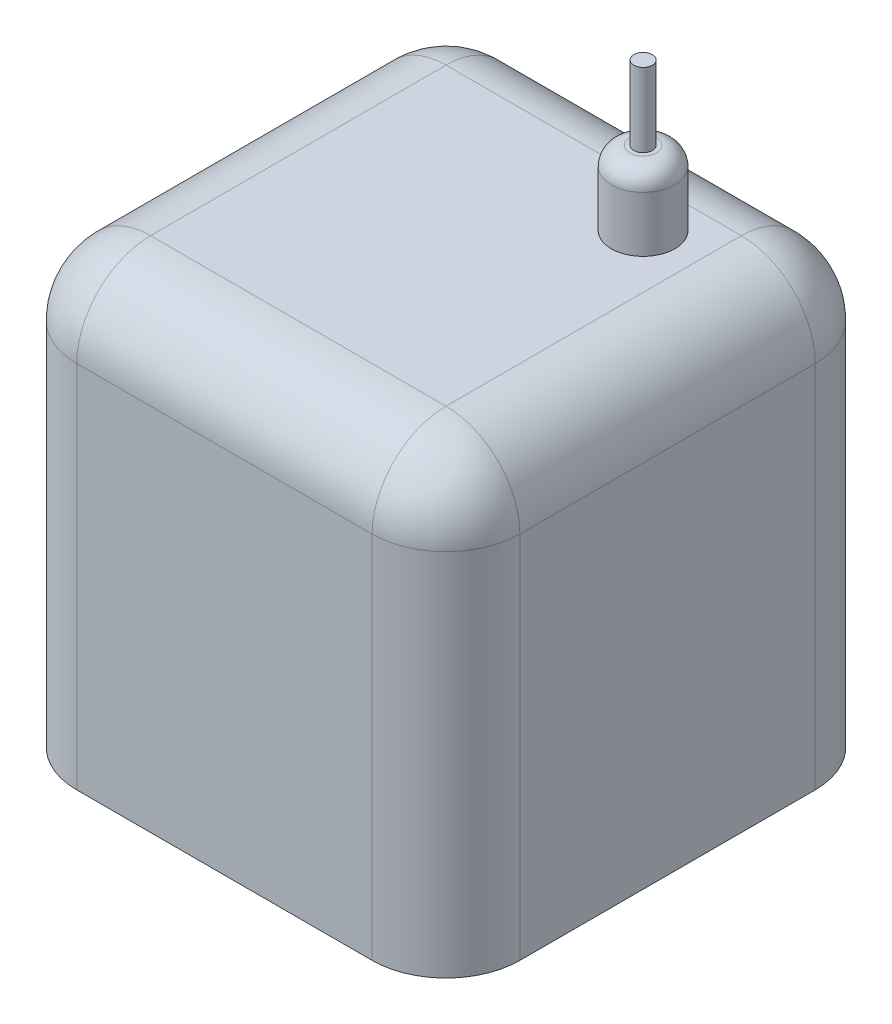
ISO-10303-21;
HEADER;
FILE_DESCRIPTION(('STEP AP214'),'2;1');
FILE_NAME('part.step','',(''),(''),'','','');
FILE_SCHEMA(('AUTOMOTIVE_DESIGN { 1 0 10303 214 1 1 1 1 }'));
ENDSEC;
DATA;
#1=APPLICATION_CONTEXT('core data for automotive mechanical design processes');
#2=APPLICATION_PROTOCOL_DEFINITION('international standard','automotive_design',2000,#1);
#3=PRODUCT_CONTEXT('',#1,'mechanical');
#4=PRODUCT('Part','Part','',(#3));
#5=PRODUCT_RELATED_PRODUCT_CATEGORY('part','',(#4));
#6=PRODUCT_DEFINITION_FORMATION('','',#4);
#7=PRODUCT_DEFINITION_CONTEXT('part definition',#1,'design');
#8=PRODUCT_DEFINITION('design','',#6,#7);
#9=PRODUCT_DEFINITION_SHAPE('','',#8);
#10=(LENGTH_UNIT() NAMED_UNIT(*) SI_UNIT(.MILLI.,.METRE.));
#11=(NAMED_UNIT(*) PLANE_ANGLE_UNIT() SI_UNIT($,.RADIAN.));
#12=(NAMED_UNIT(*) SI_UNIT($,.STERADIAN.) SOLID_ANGLE_UNIT());
#13=UNCERTAINTY_MEASURE_WITH_UNIT(LENGTH_MEASURE(1.E-05),#10,'distance_accuracy_value','');
#14=(GEOMETRIC_REPRESENTATION_CONTEXT(3) GLOBAL_UNCERTAINTY_ASSIGNED_CONTEXT((#13)) GLOBAL_UNIT_ASSIGNED_CONTEXT((#10,
#11,#12)) REPRESENTATION_CONTEXT('',''));
#15=CARTESIAN_POINT('',(0.,0.,0.));
#16=DIRECTION('',(0.,0.,1.));
#17=DIRECTION('',(1.,0.,0.));
#18=AXIS2_PLACEMENT_3D('',#15,#16,#17);
#19=CARTESIAN_POINT('',(114.,120.,-13.7159679047042));
#20=DIRECTION('',(-1.,0.,0.));
#21=DIRECTION('',(0.,0.,1.));
#22=AXIS2_PLACEMENT_3D('',#19,#20,#21);
#23=PLANE('',#22);
#24=DIRECTION('',(0.,0.,-1.));
#25=VECTOR('',#24,1.);
#26=CARTESIAN_POINT('',(114.,100.,106.284032095296));
#27=LINE('',#26,#25);
#28=CARTESIAN_POINT('',(114.,100.,6.28403209529576));
#29=VERTEX_POINT('',#28);
#30=CARTESIAN_POINT('',(114.,100.,86.2840320952958));
#31=VERTEX_POINT('',#30);
#32=EDGE_CURVE('E48',#29,#31,#27,.F.);
#33=ORIENTED_EDGE('',*,*,#32,.T.);
#34=DIRECTION('',(0.,-1.,0.));
#35=VECTOR('',#34,1.);
#36=CARTESIAN_POINT('',(114.,120.,86.2840320952958));
#37=LINE('',#36,#35);
#38=CARTESIAN_POINT('',(114.,0.,86.2840320952958));
#39=VERTEX_POINT('',#38);
#40=EDGE_CURVE('E169',#31,#39,#37,.T.);
#41=ORIENTED_EDGE('',*,*,#40,.T.);
#42=DIRECTION('',(0.,0.,-1.));
#43=VECTOR('',#42,1.);
#44=CARTESIAN_POINT('',(114.,0.,-13.7159679047042));
#45=LINE('',#44,#43);
#46=CARTESIAN_POINT('',(114.,0.,6.28403209529576));
#47=VERTEX_POINT('',#46);
#48=EDGE_CURVE('E201',#39,#47,#45,.T.);
#49=ORIENTED_EDGE('',*,*,#48,.T.);
#50=DIRECTION('',(0.,-1.,0.));
#51=VECTOR('',#50,1.);
#52=CARTESIAN_POINT('',(114.,120.,6.28403209529576));
#53=LINE('',#52,#51);
#54=EDGE_CURVE('E53',#47,#29,#53,.F.);
#55=ORIENTED_EDGE('',*,*,#54,.T.);
#56=EDGE_LOOP('',(#33,#41,#49,#55));
#57=FACE_BOUND('',#56,.T.);
#58=ADVANCED_FACE('F33',(#57),#23,.F.);
#59=CARTESIAN_POINT('',(-6.,120.,-13.7159679047042));
#60=DIRECTION('',(0.,0.,1.));
#61=DIRECTION('',(1.,0.,0.));
#62=AXIS2_PLACEMENT_3D('',#59,#60,#61);
#63=PLANE('',#62);
#64=DIRECTION('',(-1.,0.,0.));
#65=VECTOR('',#64,1.);
#66=CARTESIAN_POINT('',(-6.,0.,-13.7159679047042));
#67=LINE('',#66,#65);
#68=CARTESIAN_POINT('',(94.,0.,-13.7159679047042));
#69=VERTEX_POINT('',#68);
#70=CARTESIAN_POINT('',(14.,0.,-13.7159679047042));
#71=VERTEX_POINT('',#70);
#72=EDGE_CURVE('E283',#69,#71,#67,.T.);
#73=ORIENTED_EDGE('',*,*,#72,.T.);
#74=DIRECTION('',(0.,-1.,0.));
#75=VECTOR('',#74,1.);
#76=CARTESIAN_POINT('',(14.,120.,-13.7159679047042));
#77=LINE('',#76,#75);
#78=CARTESIAN_POINT('',(14.,100.,-13.7159679047042));
#79=VERTEX_POINT('',#78);
#80=EDGE_CURVE('E165',#71,#79,#77,.F.);
#81=ORIENTED_EDGE('',*,*,#80,.T.);
#82=DIRECTION('',(-1.,0.,0.));
#83=VECTOR('',#82,1.);
#84=CARTESIAN_POINT('',(114.,100.,-13.7159679047042));
#85=LINE('',#84,#83);
#86=CARTESIAN_POINT('',(94.,100.,-13.7159679047042));
#87=VERTEX_POINT('',#86);
#88=EDGE_CURVE('E163',#79,#87,#85,.F.);
#89=ORIENTED_EDGE('',*,*,#88,.T.);
#90=DIRECTION('',(0.,-1.,0.));
#91=VECTOR('',#90,1.);
#92=CARTESIAN_POINT('',(94.,120.,-13.7159679047042));
#93=LINE('',#92,#91);
#94=EDGE_CURVE('E161',#87,#69,#93,.T.);
#95=ORIENTED_EDGE('',*,*,#94,.T.);
#96=EDGE_LOOP('',(#73,#81,#89,#95));
#97=FACE_BOUND('',#96,.T.);
#98=ADVANCED_FACE('F219',(#97),#63,.F.);
#99=CARTESIAN_POINT('',(-6.,120.,-13.7159679047042));
#100=DIRECTION('',(1.,0.,0.));
#101=DIRECTION('',(0.,0.,-1.));
#102=AXIS2_PLACEMENT_3D('',#99,#100,#101);
#103=PLANE('',#102);
#104=DIRECTION('',(0.,0.,1.));
#105=VECTOR('',#104,1.);
#106=CARTESIAN_POINT('',(-6.,100.,-13.7159679047042));
#107=LINE('',#106,#105);
#108=CARTESIAN_POINT('',(-5.99999999999999,100.,86.2840320952958));
#109=VERTEX_POINT('',#108);
#110=CARTESIAN_POINT('',(-6.,100.,6.28403209529577));
#111=VERTEX_POINT('',#110);
#112=EDGE_CURVE('E157',#109,#111,#107,.F.);
#113=ORIENTED_EDGE('',*,*,#112,.T.);
#114=DIRECTION('',(0.,-1.,0.));
#115=VECTOR('',#114,1.);
#116=CARTESIAN_POINT('',(-6.,120.,6.28403209529577));
#117=LINE('',#116,#115);
#118=CARTESIAN_POINT('',(-6.,0.,6.28403209529577));
#119=VERTEX_POINT('',#118);
#120=EDGE_CURVE('E159',#111,#119,#117,.T.);
#121=ORIENTED_EDGE('',*,*,#120,.T.);
#122=DIRECTION('',(0.,0.,1.));
#123=VECTOR('',#122,1.);
#124=CARTESIAN_POINT('',(-6.,0.,-13.7159679047042));
#125=LINE('',#124,#123);
#126=CARTESIAN_POINT('',(-5.99999999999999,0.,86.2840320952958));
#127=VERTEX_POINT('',#126);
#128=EDGE_CURVE('E286',#119,#127,#125,.T.);
#129=ORIENTED_EDGE('',*,*,#128,.T.);
#130=DIRECTION('',(0.,-1.,0.));
#131=VECTOR('',#130,1.);
#132=CARTESIAN_POINT('',(-5.99999999999999,120.,86.2840320952958));
#133=LINE('',#132,#131);
#134=EDGE_CURVE('E155',#127,#109,#133,.F.);
#135=ORIENTED_EDGE('',*,*,#134,.T.);
#136=EDGE_LOOP('',(#113,#121,#129,#135));
#137=FACE_BOUND('',#136,.T.);
#138=ADVANCED_FACE('F224',(#137),#103,.F.);
#139=CARTESIAN_POINT('',(-5.99999999999999,120.,106.284032095296));
#140=DIRECTION('',(0.,0.,-1.));
#141=DIRECTION('',(-1.,0.,0.));
#142=AXIS2_PLACEMENT_3D('',#139,#140,#141);
#143=PLANE('',#142);
#144=DIRECTION('',(1.,0.,0.));
#145=VECTOR('',#144,1.);
#146=CARTESIAN_POINT('',(-5.99999999999999,0.,106.284032095296));
#147=LINE('',#146,#145);
#148=CARTESIAN_POINT('',(14.,0.,106.284032095296));
#149=VERTEX_POINT('',#148);
#150=CARTESIAN_POINT('',(94.,0.,106.284032095296));
#151=VERTEX_POINT('',#150);
#152=EDGE_CURVE('E140',#149,#151,#147,.T.);
#153=ORIENTED_EDGE('',*,*,#152,.T.);
#154=DIRECTION('',(0.,-1.,0.));
#155=VECTOR('',#154,1.);
#156=CARTESIAN_POINT('',(94.,120.,106.284032095296));
#157=LINE('',#156,#155);
#158=CARTESIAN_POINT('',(94.,100.,106.284032095296));
#159=VERTEX_POINT('',#158);
#160=EDGE_CURVE('E153',#151,#159,#157,.F.);
#161=ORIENTED_EDGE('',*,*,#160,.T.);
#162=DIRECTION('',(1.,0.,0.));
#163=VECTOR('',#162,1.);
#164=CARTESIAN_POINT('',(-5.99999999999999,100.,106.284032095296));
#165=LINE('',#164,#163);
#166=CARTESIAN_POINT('',(14.,100.,106.284032095296));
#167=VERTEX_POINT('',#166);
#168=EDGE_CURVE('E117',#159,#167,#165,.F.);
#169=ORIENTED_EDGE('',*,*,#168,.T.);
#170=DIRECTION('',(0.,-1.,0.));
#171=VECTOR('',#170,1.);
#172=CARTESIAN_POINT('',(14.,120.,106.284032095296));
#173=LINE('',#172,#171);
#174=EDGE_CURVE('E146',#167,#149,#173,.T.);
#175=ORIENTED_EDGE('',*,*,#174,.T.);
#176=EDGE_LOOP('',(#153,#161,#169,#175));
#177=FACE_BOUND('',#176,.T.);
#178=ADVANCED_FACE('F306',(#177),#143,.F.);
#179=CARTESIAN_POINT('',(0.,120.,0.));
#180=DIRECTION('',(0.,1.,0.));
#181=DIRECTION('',(0.,0.,1.));
#182=AXIS2_PLACEMENT_3D('',#179,#180,#181);
#183=PLANE('',#182);
#184=CARTESIAN_POINT('',(79.4733305585282,120.,18.3747120850057));
#185=DIRECTION('',(0.,1.,0.));
#186=DIRECTION('',(0.,0.,1.));
#187=AXIS2_PLACEMENT_3D('',#184,#185,#186);
#188=CIRCLE('',#187,8.60645730022537);
#189=CARTESIAN_POINT('',(79.4733305585282,120.,26.9811693852311));
#190=VERTEX_POINT('',#189);
#191=EDGE_CURVE('E121',#190,#190,#188,.T.);
#192=ORIENTED_EDGE('',*,*,#191,.F.);
#193=EDGE_LOOP('',(#192));
#194=FACE_BOUND('',#193,.T.);
#195=DIRECTION('',(0.,0.,1.));
#196=VECTOR('',#195,1.);
#197=CARTESIAN_POINT('',(14.,120.,106.284032095296));
#198=LINE('',#197,#196);
#199=CARTESIAN_POINT('',(14.,120.,6.28403209529577));
#200=VERTEX_POINT('',#199);
#201=CARTESIAN_POINT('',(14.,120.,86.2840320952958));
#202=VERTEX_POINT('',#201);
#203=EDGE_CURVE('E144',#200,#202,#198,.T.);
#204=ORIENTED_EDGE('',*,*,#203,.T.);
#205=DIRECTION('',(1.,0.,0.));
#206=VECTOR('',#205,1.);
#207=CARTESIAN_POINT('',(114.,120.,86.2840320952958));
#208=LINE('',#207,#206);
#209=CARTESIAN_POINT('',(94.,120.,86.2840320952958));
#210=VERTEX_POINT('',#209);
#211=EDGE_CURVE('E115',#202,#210,#208,.T.);
#212=ORIENTED_EDGE('',*,*,#211,.T.);
#213=DIRECTION('',(0.,0.,-1.));
#214=VECTOR('',#213,1.);
#215=CARTESIAN_POINT('',(94.,120.,-13.7159679047042));
#216=LINE('',#215,#214);
#217=CARTESIAN_POINT('',(94.,120.,6.28403209529576));
#218=VERTEX_POINT('',#217);
#219=EDGE_CURVE('E133',#210,#218,#216,.T.);
#220=ORIENTED_EDGE('',*,*,#219,.T.);
#221=DIRECTION('',(-1.,0.,0.));
#222=VECTOR('',#221,1.);
#223=CARTESIAN_POINT('',(-6.,120.,6.28403209529577));
#224=LINE('',#223,#222);
#225=EDGE_CURVE('E139',#218,#200,#224,.T.);
#226=ORIENTED_EDGE('',*,*,#225,.T.);
#227=EDGE_LOOP('',(#204,#212,#220,#226));
#228=FACE_BOUND('',#227,.T.);
#229=ADVANCED_FACE('F142',(#194,#228),#183,.T.);
#230=CARTESIAN_POINT('',(0.,0.,0.));
#231=DIRECTION('',(0.,1.,0.));
#232=DIRECTION('',(0.,0.,1.));
#233=AXIS2_PLACEMENT_3D('',#230,#231,#232);
#234=PLANE('',#233);
#235=ORIENTED_EDGE('',*,*,#128,.F.);
#236=CARTESIAN_POINT('',(14.,0.,6.28403209529577));
#237=DIRECTION('',(0.,1.,0.));
#238=DIRECTION('',(0.,0.,1.));
#239=AXIS2_PLACEMENT_3D('',#236,#237,#238);
#240=CIRCLE('',#239,20.);
#241=EDGE_CURVE('E177',#119,#71,#240,.F.);
#242=ORIENTED_EDGE('',*,*,#241,.T.);
#243=ORIENTED_EDGE('',*,*,#72,.F.);
#244=CARTESIAN_POINT('',(94.,0.,6.28403209529576));
#245=DIRECTION('',(0.,1.,0.));
#246=DIRECTION('',(0.,0.,1.));
#247=AXIS2_PLACEMENT_3D('',#244,#245,#246);
#248=CIRCLE('',#247,20.);
#249=EDGE_CURVE('E173',#69,#47,#248,.F.);
#250=ORIENTED_EDGE('',*,*,#249,.T.);
#251=ORIENTED_EDGE('',*,*,#48,.F.);
#252=CARTESIAN_POINT('',(94.,0.,86.2840320952958));
#253=DIRECTION('',(0.,1.,0.));
#254=DIRECTION('',(0.,0.,1.));
#255=AXIS2_PLACEMENT_3D('',#252,#253,#254);
#256=CIRCLE('',#255,20.);
#257=EDGE_CURVE('E175',#39,#151,#256,.F.);
#258=ORIENTED_EDGE('',*,*,#257,.T.);
#259=ORIENTED_EDGE('',*,*,#152,.F.);
#260=CARTESIAN_POINT('',(14.,0.,86.2840320952958));
#261=DIRECTION('',(0.,1.,0.));
#262=DIRECTION('',(0.,0.,1.));
#263=AXIS2_PLACEMENT_3D('',#260,#261,#262);
#264=CIRCLE('',#263,20.);
#265=EDGE_CURVE('E171',#149,#127,#264,.F.);
#266=ORIENTED_EDGE('',*,*,#265,.T.);
#267=EDGE_LOOP('',(#235,#242,#243,#250,#251,#258,#259,#266));
#268=FACE_BOUND('',#267,.T.);
#269=ADVANCED_FACE('F269',(#268),#234,.F.);
#270=CARTESIAN_POINT('',(14.,120.,6.28403209529577));
#271=DIRECTION('',(0.,-1.,0.));
#272=DIRECTION('',(0.,0.,-1.));
#273=AXIS2_PLACEMENT_3D('',#270,#271,#272);
#274=CYLINDRICAL_SURFACE('',#273,20.);
#275=ORIENTED_EDGE('',*,*,#241,.F.);
#276=ORIENTED_EDGE('',*,*,#120,.F.);
#277=CARTESIAN_POINT('',(14.,100.,6.28403209529577));
#278=DIRECTION('',(0.,1.,0.));
#279=DIRECTION('',(0.,0.,1.));
#280=AXIS2_PLACEMENT_3D('',#277,#278,#279);
#281=CIRCLE('',#280,20.);
#282=EDGE_CURVE('E199',#79,#111,#281,.T.);
#283=ORIENTED_EDGE('',*,*,#282,.F.);
#284=ORIENTED_EDGE('',*,*,#80,.F.);
#285=EDGE_LOOP('',(#275,#276,#283,#284));
#286=FACE_BOUND('',#285,.T.);
#287=ADVANCED_FACE('F266',(#286),#274,.T.);
#288=CARTESIAN_POINT('',(0.,100.,6.28403209529577));
#289=DIRECTION('',(1.,0.,0.));
#290=DIRECTION('',(0.,0.,-1.));
#291=AXIS2_PLACEMENT_3D('',#288,#289,#290);
#292=CYLINDRICAL_SURFACE('',#291,20.);
#293=CARTESIAN_POINT('',(94.,100.,6.28403209529576));
#294=DIRECTION('',(1.,0.,0.));
#295=DIRECTION('',(0.,0.,-1.));
#296=AXIS2_PLACEMENT_3D('',#293,#294,#295);
#297=CIRCLE('',#296,20.);
#298=EDGE_CURVE('E193',#87,#218,#297,.T.);
#299=ORIENTED_EDGE('',*,*,#298,.F.);
#300=ORIENTED_EDGE('',*,*,#88,.F.);
#301=CARTESIAN_POINT('',(14.,100.,6.28403209529577));
#302=DIRECTION('',(-1.,0.,0.));
#303=DIRECTION('',(0.,0.,1.));
#304=AXIS2_PLACEMENT_3D('',#301,#302,#303);
#305=CIRCLE('',#304,20.);
#306=EDGE_CURVE('E196',#200,#79,#305,.T.);
#307=ORIENTED_EDGE('',*,*,#306,.F.);
#308=ORIENTED_EDGE('',*,*,#225,.F.);
#309=EDGE_LOOP('',(#299,#300,#307,#308));
#310=FACE_BOUND('',#309,.T.);
#311=ADVANCED_FACE('F263',(#310),#292,.T.);
#312=CARTESIAN_POINT('',(94.,120.,6.28403209529576));
#313=DIRECTION('',(0.,-1.,0.));
#314=DIRECTION('',(0.,0.,-1.));
#315=AXIS2_PLACEMENT_3D('',#312,#313,#314);
#316=CYLINDRICAL_SURFACE('',#315,20.);
#317=ORIENTED_EDGE('',*,*,#249,.F.);
#318=ORIENTED_EDGE('',*,*,#94,.F.);
#319=CARTESIAN_POINT('',(94.,100.,6.28403209529576));
#320=DIRECTION('',(0.,1.,0.));
#321=DIRECTION('',(0.,0.,1.));
#322=AXIS2_PLACEMENT_3D('',#319,#320,#321);
#323=CIRCLE('',#322,20.);
#324=EDGE_CURVE('E190',#29,#87,#323,.T.);
#325=ORIENTED_EDGE('',*,*,#324,.F.);
#326=ORIENTED_EDGE('',*,*,#54,.F.);
#327=EDGE_LOOP('',(#317,#318,#325,#326));
#328=FACE_BOUND('',#327,.T.);
#329=ADVANCED_FACE('F259',(#328),#316,.T.);
#330=CARTESIAN_POINT('',(14.,100.,6.28403209529577));
#331=DIRECTION('',(0.,0.,1.));
#332=DIRECTION('',(1.,0.,0.));
#333=AXIS2_PLACEMENT_3D('',#330,#331,#332);
#334=SPHERICAL_SURFACE('',#333,20.);
#335=ORIENTED_EDGE('',*,*,#306,.T.);
#336=ORIENTED_EDGE('',*,*,#282,.T.);
#337=CARTESIAN_POINT('',(14.,100.,6.28403209529577));
#338=DIRECTION('',(0.,0.,-1.));
#339=DIRECTION('',(-1.,0.,0.));
#340=AXIS2_PLACEMENT_3D('',#337,#338,#339);
#341=CIRCLE('',#340,20.);
#342=EDGE_CURVE('E187',#200,#111,#341,.F.);
#343=ORIENTED_EDGE('',*,*,#342,.F.);
#344=EDGE_LOOP('',(#335,#336,#343));
#345=FACE_BOUND('',#344,.T.);
#346=ADVANCED_FACE('F255',(#345),#334,.T.);
#347=CARTESIAN_POINT('',(94.,100.,6.28403209529576));
#348=DIRECTION('',(0.,0.,1.));
#349=DIRECTION('',(1.,0.,0.));
#350=AXIS2_PLACEMENT_3D('',#347,#348,#349);
#351=SPHERICAL_SURFACE('',#350,20.);
#352=ORIENTED_EDGE('',*,*,#324,.T.);
#353=ORIENTED_EDGE('',*,*,#298,.T.);
#354=CARTESIAN_POINT('',(94.,100.,6.28403209529576));
#355=DIRECTION('',(0.,0.,-1.));
#356=DIRECTION('',(-1.,0.,0.));
#357=AXIS2_PLACEMENT_3D('',#354,#355,#356);
#358=CIRCLE('',#357,20.);
#359=EDGE_CURVE('E136',#29,#218,#358,.F.);
#360=ORIENTED_EDGE('',*,*,#359,.F.);
#361=EDGE_LOOP('',(#352,#353,#360));
#362=FACE_BOUND('',#361,.T.);
#363=ADVANCED_FACE('F251',(#362),#351,.T.);
#364=CARTESIAN_POINT('',(14.,120.,86.2840320952958));
#365=DIRECTION('',(0.,-1.,0.));
#366=DIRECTION('',(0.,0.,-1.));
#367=AXIS2_PLACEMENT_3D('',#364,#365,#366);
#368=CYLINDRICAL_SURFACE('',#367,20.);
#369=ORIENTED_EDGE('',*,*,#265,.F.);
#370=ORIENTED_EDGE('',*,*,#174,.F.);
#371=CARTESIAN_POINT('',(14.,100.,86.2840320952958));
#372=DIRECTION('',(0.,1.,0.));
#373=DIRECTION('',(0.,0.,1.));
#374=AXIS2_PLACEMENT_3D('',#371,#372,#373);
#375=CIRCLE('',#374,20.);
#376=EDGE_CURVE('E183',#109,#167,#375,.T.);
#377=ORIENTED_EDGE('',*,*,#376,.F.);
#378=ORIENTED_EDGE('',*,*,#134,.F.);
#379=EDGE_LOOP('',(#369,#370,#377,#378));
#380=FACE_BOUND('',#379,.T.);
#381=ADVANCED_FACE('F247',(#380),#368,.T.);
#382=CARTESIAN_POINT('',(14.,100.,0.));
#383=DIRECTION('',(0.,0.,-1.));
#384=DIRECTION('',(-1.,0.,0.));
#385=AXIS2_PLACEMENT_3D('',#382,#383,#384);
#386=CYLINDRICAL_SURFACE('',#385,20.);
#387=ORIENTED_EDGE('',*,*,#342,.T.);
#388=ORIENTED_EDGE('',*,*,#112,.F.);
#389=CARTESIAN_POINT('',(14.,100.,86.2840320952958));
#390=DIRECTION('',(0.,0.,1.));
#391=DIRECTION('',(1.,0.,0.));
#392=AXIS2_PLACEMENT_3D('',#389,#390,#391);
#393=CIRCLE('',#392,20.);
#394=EDGE_CURVE('E130',#202,#109,#393,.T.);
#395=ORIENTED_EDGE('',*,*,#394,.F.);
#396=ORIENTED_EDGE('',*,*,#203,.F.);
#397=EDGE_LOOP('',(#387,#388,#395,#396));
#398=FACE_BOUND('',#397,.T.);
#399=ADVANCED_FACE('F244',(#398),#386,.T.);
#400=CARTESIAN_POINT('',(94.,100.,0.));
#401=DIRECTION('',(0.,0.,1.));
#402=DIRECTION('',(1.,0.,0.));
#403=AXIS2_PLACEMENT_3D('',#400,#401,#402);
#404=CYLINDRICAL_SURFACE('',#403,20.);
#405=ORIENTED_EDGE('',*,*,#359,.T.);
#406=ORIENTED_EDGE('',*,*,#219,.F.);
#407=CARTESIAN_POINT('',(94.,100.,86.2840320952958));
#408=DIRECTION('',(0.,0.,1.));
#409=DIRECTION('',(1.,0.,0.));
#410=AXIS2_PLACEMENT_3D('',#407,#408,#409);
#411=CIRCLE('',#410,20.);
#412=EDGE_CURVE('E124',#31,#210,#411,.T.);
#413=ORIENTED_EDGE('',*,*,#412,.F.);
#414=ORIENTED_EDGE('',*,*,#32,.F.);
#415=EDGE_LOOP('',(#405,#406,#413,#414));
#416=FACE_BOUND('',#415,.T.);
#417=ADVANCED_FACE('F134',(#416),#404,.T.);
#418=CARTESIAN_POINT('',(94.,120.,86.2840320952958));
#419=DIRECTION('',(0.,-1.,0.));
#420=DIRECTION('',(0.,0.,-1.));
#421=AXIS2_PLACEMENT_3D('',#418,#419,#420);
#422=CYLINDRICAL_SURFACE('',#421,20.);
#423=ORIENTED_EDGE('',*,*,#257,.F.);
#424=ORIENTED_EDGE('',*,*,#40,.F.);
#425=CARTESIAN_POINT('',(94.,100.,86.2840320952958));
#426=DIRECTION('',(0.,1.,0.));
#427=DIRECTION('',(0.,0.,1.));
#428=AXIS2_PLACEMENT_3D('',#425,#426,#427);
#429=CIRCLE('',#428,20.);
#430=EDGE_CURVE('E128',#159,#31,#429,.T.);
#431=ORIENTED_EDGE('',*,*,#430,.F.);
#432=ORIENTED_EDGE('',*,*,#160,.F.);
#433=EDGE_LOOP('',(#423,#424,#431,#432));
#434=FACE_BOUND('',#433,.T.);
#435=ADVANCED_FACE('F237',(#434),#422,.T.);
#436=CARTESIAN_POINT('',(14.,100.,86.2840320952958));
#437=DIRECTION('',(0.,0.,1.));
#438=DIRECTION('',(1.,0.,0.));
#439=AXIS2_PLACEMENT_3D('',#436,#437,#438);
#440=SPHERICAL_SURFACE('',#439,20.);
#441=ORIENTED_EDGE('',*,*,#394,.T.);
#442=ORIENTED_EDGE('',*,*,#376,.T.);
#443=CARTESIAN_POINT('',(14.,100.,86.2840320952958));
#444=DIRECTION('',(-1.,0.,0.));
#445=DIRECTION('',(0.,0.,1.));
#446=AXIS2_PLACEMENT_3D('',#443,#444,#445);
#447=CIRCLE('',#446,20.);
#448=EDGE_CURVE('E120',#202,#167,#447,.F.);
#449=ORIENTED_EDGE('',*,*,#448,.F.);
#450=EDGE_LOOP('',(#441,#442,#449));
#451=FACE_BOUND('',#450,.T.);
#452=ADVANCED_FACE('F234',(#451),#440,.T.);
#453=CARTESIAN_POINT('',(94.,100.,86.2840320952958));
#454=DIRECTION('',(0.,0.,1.));
#455=DIRECTION('',(1.,0.,0.));
#456=AXIS2_PLACEMENT_3D('',#453,#454,#455);
#457=SPHERICAL_SURFACE('',#456,20.);
#458=ORIENTED_EDGE('',*,*,#430,.T.);
#459=ORIENTED_EDGE('',*,*,#412,.T.);
#460=CARTESIAN_POINT('',(94.,100.,86.2840320952958));
#461=DIRECTION('',(1.,0.,0.));
#462=DIRECTION('',(0.,0.,-1.));
#463=AXIS2_PLACEMENT_3D('',#460,#461,#462);
#464=CIRCLE('',#463,20.);
#465=EDGE_CURVE('E111',#159,#210,#464,.F.);
#466=ORIENTED_EDGE('',*,*,#465,.F.);
#467=EDGE_LOOP('',(#458,#459,#466));
#468=FACE_BOUND('',#467,.T.);
#469=ADVANCED_FACE('F126',(#468),#457,.T.);
#470=CARTESIAN_POINT('',(0.,100.,86.2840320952958));
#471=DIRECTION('',(-1.,0.,0.));
#472=DIRECTION('',(0.,0.,1.));
#473=AXIS2_PLACEMENT_3D('',#470,#471,#472);
#474=CYLINDRICAL_SURFACE('',#473,20.);
#475=ORIENTED_EDGE('',*,*,#448,.T.);
#476=ORIENTED_EDGE('',*,*,#168,.F.);
#477=ORIENTED_EDGE('',*,*,#465,.T.);
#478=ORIENTED_EDGE('',*,*,#211,.F.);
#479=EDGE_LOOP('',(#475,#476,#477,#478));
#480=FACE_BOUND('',#479,.T.);
#481=ADVANCED_FACE('F113',(#480),#474,.T.);
#482=CARTESIAN_POINT('',(79.4733305585282,140.,18.3747120850057));
#483=DIRECTION('',(0.,-1.,0.));
#484=DIRECTION('',(0.,0.,-1.));
#485=AXIS2_PLACEMENT_3D('',#482,#483,#484);
#486=CYLINDRICAL_SURFACE('',#485,8.60645730022537);
#487=CARTESIAN_POINT('',(79.4733305585282,135.,18.3747120850057));
#488=DIRECTION('',(0.,1.,0.));
#489=DIRECTION('',(0.,0.,1.));
#490=AXIS2_PLACEMENT_3D('',#487,#488,#489);
#491=CIRCLE('',#490,8.60645730022537);
#492=CARTESIAN_POINT('',(79.4733305585282,135.,26.9811693852311));
#493=VERTEX_POINT('',#492);
#494=EDGE_CURVE('E11',#493,#493,#491,.F.);
#495=ORIENTED_EDGE('',*,*,#494,.T.);
#496=EDGE_LOOP('',(#495));
#497=FACE_BOUND('',#496,.T.);
#498=ORIENTED_EDGE('',*,*,#191,.T.);
#499=EDGE_LOOP('',(#498));
#500=FACE_BOUND('',#499,.T.);
#501=ADVANCED_FACE('F231',(#497,#500),#486,.T.);
#502=CARTESIAN_POINT('',(79.4733305585282,140.,18.3747120850057));
#503=DIRECTION('',(0.,1.,0.));
#504=DIRECTION('',(0.,0.,1.));
#505=AXIS2_PLACEMENT_3D('',#502,#503,#504);
#506=PLANE('',#505);
#507=CARTESIAN_POINT('',(79.4733305585282,140.,18.3747120850057));
#508=DIRECTION('',(0.,1.,0.));
#509=DIRECTION('',(0.,0.,1.));
#510=AXIS2_PLACEMENT_3D('',#507,#508,#509);
#511=CIRCLE('',#510,3.60645730022537);
#512=CARTESIAN_POINT('',(79.4733305585282,140.,21.9811693852311));
#513=VERTEX_POINT('',#512);
#514=EDGE_CURVE('E41',#513,#513,#511,.T.);
#515=ORIENTED_EDGE('',*,*,#514,.T.);
#516=EDGE_LOOP('',(#515));
#517=FACE_BOUND('',#516,.T.);
#518=CARTESIAN_POINT('',(79.4733305585282,140.,18.3747120850057));
#519=DIRECTION('',(0.,1.,0.));
#520=DIRECTION('',(0.,0.,1.));
#521=AXIS2_PLACEMENT_3D('',#518,#519,#520);
#522=CIRCLE('',#521,2.5);
#523=CARTESIAN_POINT('',(79.4733305585282,140.,20.8747120850057));
#524=VERTEX_POINT('',#523);
#525=EDGE_CURVE('E335',#524,#524,#522,.T.);
#526=ORIENTED_EDGE('',*,*,#525,.F.);
#527=EDGE_LOOP('',(#526));
#528=FACE_BOUND('',#527,.T.);
#529=ADVANCED_FACE('F205',(#517,#528),#506,.T.);
#530=CARTESIAN_POINT('',(79.4733305585282,160.,18.3747120850057));
#531=DIRECTION('',(0.,-1.,0.));
#532=DIRECTION('',(0.,0.,-1.));
#533=AXIS2_PLACEMENT_3D('',#530,#531,#532);
#534=CYLINDRICAL_SURFACE('',#533,2.5);
#535=CARTESIAN_POINT('',(79.4733305585282,160.,18.3747120850057));
#536=DIRECTION('',(0.,1.,0.));
#537=DIRECTION('',(0.,0.,1.));
#538=AXIS2_PLACEMENT_3D('',#535,#536,#537);
#539=CIRCLE('',#538,2.5);
#540=CARTESIAN_POINT('',(79.4733305585282,160.,20.8747120850057));
#541=VERTEX_POINT('',#540);
#542=EDGE_CURVE('E332',#541,#541,#539,.T.);
#543=ORIENTED_EDGE('',*,*,#542,.F.);
#544=EDGE_LOOP('',(#543));
#545=FACE_BOUND('',#544,.T.);
#546=ORIENTED_EDGE('',*,*,#525,.T.);
#547=EDGE_LOOP('',(#546));
#548=FACE_BOUND('',#547,.T.);
#549=ADVANCED_FACE('F214',(#545,#548),#534,.T.);
#550=CARTESIAN_POINT('',(79.4733305585282,160.,18.3747120850057));
#551=DIRECTION('',(0.,1.,0.));
#552=DIRECTION('',(0.,0.,1.));
#553=AXIS2_PLACEMENT_3D('',#550,#551,#552);
#554=PLANE('',#553);
#555=ORIENTED_EDGE('',*,*,#542,.T.);
#556=EDGE_LOOP('',(#555));
#557=FACE_BOUND('',#556,.T.);
#558=ADVANCED_FACE('F209',(#557),#554,.T.);
#559=CARTESIAN_POINT('',(79.4733305585282,135.,18.3747120850057));
#560=DIRECTION('',(0.,1.,0.));
#561=DIRECTION('',(0.,0.,1.));
#562=AXIS2_PLACEMENT_3D('',#559,#560,#561);
#563=DEGENERATE_TOROIDAL_SURFACE('',#562,3.60645730022537,5.,.T.);
#564=ORIENTED_EDGE('',*,*,#494,.F.);
#565=EDGE_LOOP('',(#564));
#566=FACE_BOUND('',#565,.T.);
#567=ORIENTED_EDGE('',*,*,#514,.F.);
#568=EDGE_LOOP('',(#567));
#569=FACE_BOUND('',#568,.T.);
#570=ADVANCED_FACE('F35',(#566,#569),#563,.T.);
#571=CLOSED_SHELL('',(#58,#98,#138,#178,#229,#269,#287,#311,#329,#346,#363,#381,#399,#417,#435,
#452,#469,#481,#501,#529,#549,#558,#570));
#572=MANIFOLD_SOLID_BREP('B2',#571);
#573=ADVANCED_BREP_SHAPE_REPRESENTATION('',(#18,#572),#14);
#574=SHAPE_DEFINITION_REPRESENTATION(#9,#573);
ENDSEC;
END-ISO-10303-21;
